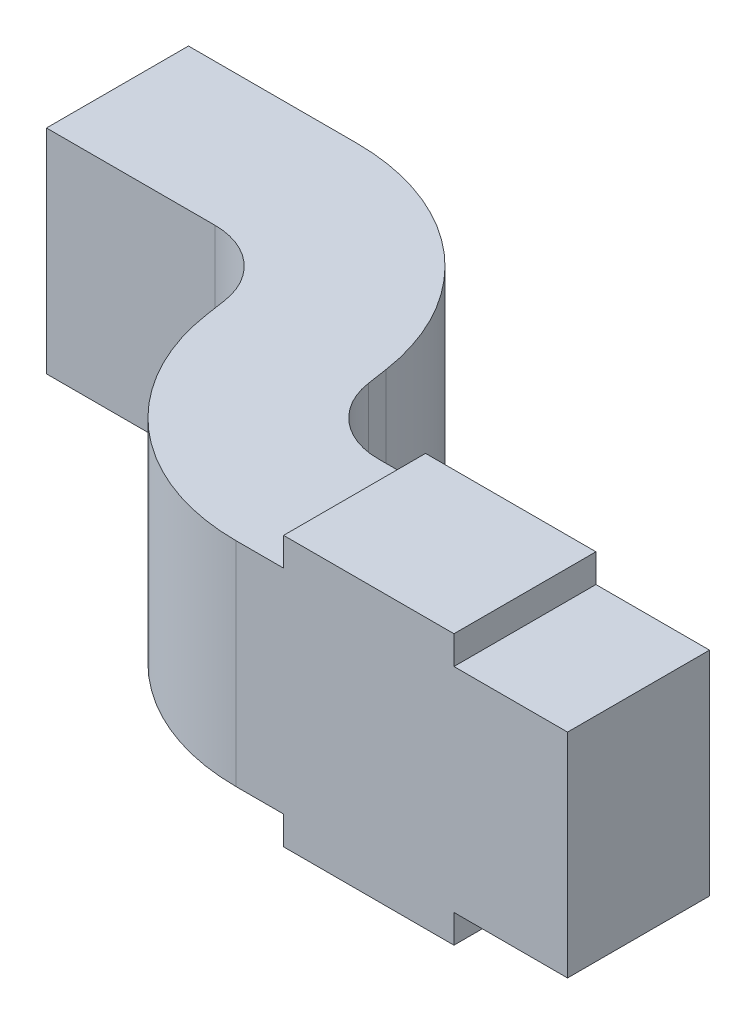
ISO-10303-21;
HEADER;
FILE_DESCRIPTION(('STEP AP214'),'2;1');
FILE_NAME('part.step','',(''),(''),'','','');
FILE_SCHEMA(('AUTOMOTIVE_DESIGN { 1 0 10303 214 1 1 1 1 }'));
ENDSEC;
DATA;
#1=APPLICATION_CONTEXT('core data for automotive mechanical design processes');
#2=APPLICATION_PROTOCOL_DEFINITION('international standard','automotive_design',2000,#1);
#3=PRODUCT_CONTEXT('',#1,'mechanical');
#4=PRODUCT('Part','Part','',(#3));
#5=PRODUCT_RELATED_PRODUCT_CATEGORY('part','',(#4));
#6=PRODUCT_DEFINITION_FORMATION('','',#4);
#7=PRODUCT_DEFINITION_CONTEXT('part definition',#1,'design');
#8=PRODUCT_DEFINITION('design','',#6,#7);
#9=PRODUCT_DEFINITION_SHAPE('','',#8);
#10=(LENGTH_UNIT() NAMED_UNIT(*) SI_UNIT(.MILLI.,.METRE.));
#11=(NAMED_UNIT(*) PLANE_ANGLE_UNIT() SI_UNIT($,.RADIAN.));
#12=(NAMED_UNIT(*) SI_UNIT($,.STERADIAN.) SOLID_ANGLE_UNIT());
#13=UNCERTAINTY_MEASURE_WITH_UNIT(LENGTH_MEASURE(1.E-05),#10,'distance_accuracy_value','');
#14=(GEOMETRIC_REPRESENTATION_CONTEXT(3) GLOBAL_UNCERTAINTY_ASSIGNED_CONTEXT((#13)) GLOBAL_UNIT_ASSIGNED_CONTEXT((#10,
#11,#12)) REPRESENTATION_CONTEXT('',''));
#15=CARTESIAN_POINT('',(0.,0.,0.));
#16=DIRECTION('',(0.,0.,1.));
#17=DIRECTION('',(1.,0.,0.));
#18=AXIS2_PLACEMENT_3D('',#15,#16,#17);
#19=CARTESIAN_POINT('',(-3.23,0.47500000000005,0.925));
#20=DIRECTION('',(0.,1.,0.));
#21=DIRECTION('',(1.,0.,0.));
#22=AXIS2_PLACEMENT_3D('',#19,#20,#21);
#23=PLANE('',#22);
#24=DIRECTION('',(1.,0.,0.));
#25=VECTOR('',#24,1.);
#26=CARTESIAN_POINT('',(-3.23,0.47500000000005,1.425));
#27=LINE('',#26,#25);
#28=CARTESIAN_POINT('',(-3.23,0.47500000000005,1.425));
#29=VERTEX_POINT('',#28);
#30=CARTESIAN_POINT('',(-2.63000000000008,0.47500000000005,1.425));
#31=VERTEX_POINT('',#30);
#32=EDGE_CURVE('E266',#29,#31,#27,.T.);
#33=ORIENTED_EDGE('',*,*,#32,.T.);
#34=DIRECTION('',(0.,0.,1.));
#35=VECTOR('',#34,1.);
#36=CARTESIAN_POINT('',(-2.63000000000008,0.47500000000005,0.925));
#37=LINE('',#36,#35);
#38=CARTESIAN_POINT('',(-2.63000000000008,0.47500000000005,0.925));
#39=VERTEX_POINT('',#38);
#40=EDGE_CURVE('E277',#39,#31,#37,.T.);
#41=ORIENTED_EDGE('',*,*,#40,.F.);
#42=DIRECTION('',(1.,0.,0.));
#43=VECTOR('',#42,1.);
#44=CARTESIAN_POINT('',(-3.23,0.47500000000005,0.925));
#45=LINE('',#44,#43);
#46=CARTESIAN_POINT('',(-3.23,0.47500000000005,0.925));
#47=VERTEX_POINT('',#46);
#48=EDGE_CURVE('E244',#47,#39,#45,.T.);
#49=ORIENTED_EDGE('',*,*,#48,.F.);
#50=DIRECTION('',(0.,0.,1.));
#51=VECTOR('',#50,1.);
#52=CARTESIAN_POINT('',(-3.23,0.47500000000005,0.925));
#53=LINE('',#52,#51);
#54=EDGE_CURVE('E390',#47,#29,#53,.T.);
#55=ORIENTED_EDGE('',*,*,#54,.T.);
#56=EDGE_LOOP('',(#33,#41,#49,#55));
#57=FACE_BOUND('',#56,.T.);
#58=ADVANCED_FACE('F17',(#57),#23,.T.);
#59=CARTESIAN_POINT('',(-3.23,-0.47499999999994,0.925));
#60=DIRECTION('',(-1.,0.,0.));
#61=DIRECTION('',(0.,0.,1.));
#62=AXIS2_PLACEMENT_3D('',#59,#60,#61);
#63=PLANE('',#62);
#64=DIRECTION('',(0.,0.,-1.));
#65=VECTOR('',#64,1.);
#66=CARTESIAN_POINT('',(-3.23,-0.375,0.85410254983609));
#67=LINE('',#66,#65);
#68=CARTESIAN_POINT('',(-3.23,-0.375,1.425));
#69=VERTEX_POINT('',#68);
#70=CARTESIAN_POINT('',(-3.23,-0.375,0.924999999999963));
#71=VERTEX_POINT('',#70);
#72=EDGE_CURVE('E240',#69,#71,#67,.T.);
#73=ORIENTED_EDGE('',*,*,#72,.T.);
#74=DIRECTION('',(0.,1.,0.));
#75=VECTOR('',#74,1.);
#76=CARTESIAN_POINT('',(-3.23,-0.47499999999994,0.925));
#77=LINE('',#76,#75);
#78=CARTESIAN_POINT('',(-3.23,-0.47499999999994,0.925));
#79=VERTEX_POINT('',#78);
#80=EDGE_CURVE('E237',#79,#71,#77,.T.);
#81=ORIENTED_EDGE('',*,*,#80,.F.);
#82=DIRECTION('',(0.,0.,1.));
#83=VECTOR('',#82,1.);
#84=CARTESIAN_POINT('',(-3.23,-0.47499999999994,0.925));
#85=LINE('',#84,#83);
#86=CARTESIAN_POINT('',(-3.23,-0.47499999999994,1.425));
#87=VERTEX_POINT('',#86);
#88=EDGE_CURVE('E11',#79,#87,#85,.T.);
#89=ORIENTED_EDGE('',*,*,#88,.T.);
#90=DIRECTION('',(0.,1.,0.));
#91=VECTOR('',#90,1.);
#92=CARTESIAN_POINT('',(-3.23,-0.47499999999994,1.425));
#93=LINE('',#92,#91);
#94=EDGE_CURVE('E270',#87,#69,#93,.T.);
#95=ORIENTED_EDGE('',*,*,#94,.T.);
#96=EDGE_LOOP('',(#73,#81,#89,#95));
#97=FACE_BOUND('',#96,.T.);
#98=ADVANCED_FACE('F238',(#97),#63,.T.);
#99=CARTESIAN_POINT('',(-2.63000000000008,-0.47499999999994,0.925));
#100=DIRECTION('',(0.,-1.,0.));
#101=DIRECTION('',(-1.,0.,0.));
#102=AXIS2_PLACEMENT_3D('',#99,#100,#101);
#103=PLANE('',#102);
#104=DIRECTION('',(-1.,0.,0.));
#105=VECTOR('',#104,1.);
#106=CARTESIAN_POINT('',(-2.63000000000008,-0.47499999999994,1.425));
#107=LINE('',#106,#105);
#108=CARTESIAN_POINT('',(-2.63000000000008,-0.47499999999994,1.425));
#109=VERTEX_POINT('',#108);
#110=EDGE_CURVE('E234',#109,#87,#107,.T.);
#111=ORIENTED_EDGE('',*,*,#110,.T.);
#112=ORIENTED_EDGE('',*,*,#88,.F.);
#113=DIRECTION('',(-1.,0.,0.));
#114=VECTOR('',#113,1.);
#115=CARTESIAN_POINT('',(-2.63000000000008,-0.47499999999994,0.925));
#116=LINE('',#115,#114);
#117=CARTESIAN_POINT('',(-2.63000000000008,-0.47499999999994,0.925));
#118=VERTEX_POINT('',#117);
#119=EDGE_CURVE('E231',#118,#79,#116,.T.);
#120=ORIENTED_EDGE('',*,*,#119,.F.);
#121=DIRECTION('',(0.,0.,1.));
#122=VECTOR('',#121,1.);
#123=CARTESIAN_POINT('',(-2.63000000000008,-0.47499999999994,0.925));
#124=LINE('',#123,#122);
#125=EDGE_CURVE('E25',#118,#109,#124,.T.);
#126=ORIENTED_EDGE('',*,*,#125,.T.);
#127=EDGE_LOOP('',(#111,#112,#120,#126));
#128=FACE_BOUND('',#127,.T.);
#129=ADVANCED_FACE('F229',(#128),#103,.T.);
#130=CARTESIAN_POINT('',(-2.63000000000008,0.47500000000005,0.925));
#131=DIRECTION('',(1.,0.,0.));
#132=DIRECTION('',(0.,-1.,0.));
#133=AXIS2_PLACEMENT_3D('',#130,#131,#132);
#134=PLANE('',#133);
#135=DIRECTION('',(0.,0.,1.));
#136=VECTOR('',#135,1.);
#137=CARTESIAN_POINT('',(-2.63000000000008,-0.375,0.85410254983609));
#138=LINE('',#137,#136);
#139=CARTESIAN_POINT('',(-2.63000000000008,-0.375,0.925));
#140=VERTEX_POINT('',#139);
#141=CARTESIAN_POINT('',(-2.63000000000008,-0.375,1.425));
#142=VERTEX_POINT('',#141);
#143=EDGE_CURVE('E473',#140,#142,#138,.T.);
#144=ORIENTED_EDGE('',*,*,#143,.T.);
#145=DIRECTION('',(0.,-1.,0.));
#146=VECTOR('',#145,1.);
#147=CARTESIAN_POINT('',(-2.63000000000008,0.47500000000005,1.425));
#148=LINE('',#147,#146);
#149=EDGE_CURVE('E275',#142,#109,#148,.T.);
#150=ORIENTED_EDGE('',*,*,#149,.T.);
#151=ORIENTED_EDGE('',*,*,#125,.F.);
#152=DIRECTION('',(0.,-1.,0.));
#153=VECTOR('',#152,1.);
#154=CARTESIAN_POINT('',(-2.63000000000008,0.47500000000005,0.925));
#155=LINE('',#154,#153);
#156=EDGE_CURVE('E248',#140,#118,#155,.T.);
#157=ORIENTED_EDGE('',*,*,#156,.F.);
#158=EDGE_LOOP('',(#144,#150,#151,#157));
#159=FACE_BOUND('',#158,.T.);
#160=ADVANCED_FACE('F551',(#159),#134,.T.);
#161=CARTESIAN_POINT('',(-2.63000000000008,0.47500000000005,0.925));
#162=DIRECTION('',(1.,0.,0.));
#163=DIRECTION('',(0.,-1.,0.));
#164=AXIS2_PLACEMENT_3D('',#161,#162,#163);
#165=PLANE('',#164);
#166=DIRECTION('',(0.,0.,-1.));
#167=VECTOR('',#166,1.);
#168=CARTESIAN_POINT('',(-2.63000000000008,0.375,0.85410254983609));
#169=LINE('',#168,#167);
#170=CARTESIAN_POINT('',(-2.63000000000008,0.375,1.425));
#171=VERTEX_POINT('',#170);
#172=CARTESIAN_POINT('',(-2.63000000000008,0.375,0.925));
#173=VERTEX_POINT('',#172);
#174=EDGE_CURVE('E312',#171,#173,#169,.T.);
#175=ORIENTED_EDGE('',*,*,#174,.T.);
#176=DIRECTION('',(0.,-1.,0.));
#177=VECTOR('',#176,1.);
#178=CARTESIAN_POINT('',(-2.63000000000008,0.47500000000005,0.925));
#179=LINE('',#178,#177);
#180=EDGE_CURVE('E260',#39,#173,#179,.T.);
#181=ORIENTED_EDGE('',*,*,#180,.F.);
#182=ORIENTED_EDGE('',*,*,#40,.T.);
#183=DIRECTION('',(0.,-1.,0.));
#184=VECTOR('',#183,1.);
#185=CARTESIAN_POINT('',(-2.63000000000008,0.47500000000005,1.425));
#186=LINE('',#185,#184);
#187=EDGE_CURVE('E263',#31,#171,#186,.T.);
#188=ORIENTED_EDGE('',*,*,#187,.T.);
#189=EDGE_LOOP('',(#175,#181,#182,#188));
#190=FACE_BOUND('',#189,.T.);
#191=ADVANCED_FACE('F553',(#190),#165,.T.);
#192=CARTESIAN_POINT('',(-2.93000000000004,0.,1.425));
#193=DIRECTION('',(0.,0.,1.));
#194=DIRECTION('',(1.,0.,0.));
#195=AXIS2_PLACEMENT_3D('',#192,#193,#194);
#196=PLANE('',#195);
#197=ORIENTED_EDGE('',*,*,#187,.F.);
#198=ORIENTED_EDGE('',*,*,#32,.F.);
#199=DIRECTION('',(0.,1.,0.));
#200=VECTOR('',#199,1.);
#201=CARTESIAN_POINT('',(-3.23,-0.47499999999994,1.425));
#202=LINE('',#201,#200);
#203=CARTESIAN_POINT('',(-3.23,0.375,1.425));
#204=VERTEX_POINT('',#203);
#205=EDGE_CURVE('E387',#204,#29,#202,.T.);
#206=ORIENTED_EDGE('',*,*,#205,.F.);
#207=DIRECTION('',(-1.,0.,0.));
#208=VECTOR('',#207,1.);
#209=CARTESIAN_POINT('',(-2.23000000000008,0.375,1.425));
#210=LINE('',#209,#208);
#211=CARTESIAN_POINT('',(-3.39710678118641,0.375,1.425));
#212=VERTEX_POINT('',#211);
#213=EDGE_CURVE('E384',#204,#212,#210,.T.);
#214=ORIENTED_EDGE('',*,*,#213,.T.);
#215=DIRECTION('',(0.,1.,0.));
#216=VECTOR('',#215,1.);
#217=CARTESIAN_POINT('',(-3.39710678118641,-0.375,1.425));
#218=LINE('',#217,#216);
#219=CARTESIAN_POINT('',(-3.39710678118641,-0.375,1.425));
#220=VERTEX_POINT('',#219);
#221=EDGE_CURVE('E372',#220,#212,#218,.T.);
#222=ORIENTED_EDGE('',*,*,#221,.F.);
#223=DIRECTION('',(-1.,0.,0.));
#224=VECTOR('',#223,1.);
#225=CARTESIAN_POINT('',(-2.23000000000008,-0.375,1.425));
#226=LINE('',#225,#224);
#227=EDGE_CURVE('E423',#69,#220,#226,.T.);
#228=ORIENTED_EDGE('',*,*,#227,.F.);
#229=ORIENTED_EDGE('',*,*,#94,.F.);
#230=ORIENTED_EDGE('',*,*,#110,.F.);
#231=ORIENTED_EDGE('',*,*,#149,.F.);
#232=DIRECTION('',(-1.,0.,0.));
#233=VECTOR('',#232,1.);
#234=CARTESIAN_POINT('',(-2.23000000000008,-0.375,1.425));
#235=LINE('',#234,#233);
#236=CARTESIAN_POINT('',(-2.23000000000008,-0.375,1.425));
#237=VERTEX_POINT('',#236);
#238=EDGE_CURVE('E430',#237,#142,#235,.T.);
#239=ORIENTED_EDGE('',*,*,#238,.F.);
#240=DIRECTION('',(0.,1.,0.));
#241=VECTOR('',#240,1.);
#242=CARTESIAN_POINT('',(-2.23000000000008,-0.375,1.425));
#243=LINE('',#242,#241);
#244=CARTESIAN_POINT('',(-2.23000000000008,0.375,1.425));
#245=VERTEX_POINT('',#244);
#246=EDGE_CURVE('E367',#237,#245,#243,.T.);
#247=ORIENTED_EDGE('',*,*,#246,.T.);
#248=DIRECTION('',(-1.,0.,0.));
#249=VECTOR('',#248,1.);
#250=CARTESIAN_POINT('',(-2.23000000000008,0.375,1.425));
#251=LINE('',#250,#249);
#252=EDGE_CURVE('E316',#245,#171,#251,.T.);
#253=ORIENTED_EDGE('',*,*,#252,.T.);
#254=EDGE_LOOP('',(#197,#198,#206,#214,#222,#228,#229,#230,#231,#239,#247,#253));
#255=FACE_BOUND('',#254,.T.);
#256=ADVANCED_FACE('F408',(#255),#196,.T.);
#257=CARTESIAN_POINT('',(-2.93000000000004,0.,0.925));
#258=DIRECTION('',(0.,0.,1.));
#259=DIRECTION('',(1.,0.,0.));
#260=AXIS2_PLACEMENT_3D('',#257,#258,#259);
#261=PLANE('',#260);
#262=ORIENTED_EDGE('',*,*,#156,.T.);
#263=ORIENTED_EDGE('',*,*,#119,.T.);
#264=ORIENTED_EDGE('',*,*,#80,.T.);
#265=DIRECTION('',(1.,0.,0.));
#266=VECTOR('',#265,1.);
#267=CARTESIAN_POINT('',(-3.39710678118641,-0.375,0.924999999999955));
#268=LINE('',#267,#266);
#269=CARTESIAN_POINT('',(-3.39710678118641,-0.375,0.924999999999955));
#270=VERTEX_POINT('',#269);
#271=EDGE_CURVE('E309',#270,#71,#268,.T.);
#272=ORIENTED_EDGE('',*,*,#271,.F.);
#273=DIRECTION('',(0.,1.,0.));
#274=VECTOR('',#273,1.);
#275=CARTESIAN_POINT('',(-3.39710678118641,-0.375,0.924999999999955));
#276=LINE('',#275,#274);
#277=CARTESIAN_POINT('',(-3.39710678118641,0.375,0.924999999999955));
#278=VERTEX_POINT('',#277);
#279=EDGE_CURVE('E492',#270,#278,#276,.T.);
#280=ORIENTED_EDGE('',*,*,#279,.T.);
#281=DIRECTION('',(1.,0.,0.));
#282=VECTOR('',#281,1.);
#283=CARTESIAN_POINT('',(-3.39710678118641,0.375,0.924999999999955));
#284=LINE('',#283,#282);
#285=CARTESIAN_POINT('',(-3.23,0.375,0.924999999999963));
#286=VERTEX_POINT('',#285);
#287=EDGE_CURVE('E330',#278,#286,#284,.T.);
#288=ORIENTED_EDGE('',*,*,#287,.T.);
#289=DIRECTION('',(0.,1.,0.));
#290=VECTOR('',#289,1.);
#291=CARTESIAN_POINT('',(-3.23,-0.47499999999994,0.925));
#292=LINE('',#291,#290);
#293=EDGE_CURVE('E255',#286,#47,#292,.T.);
#294=ORIENTED_EDGE('',*,*,#293,.T.);
#295=ORIENTED_EDGE('',*,*,#48,.T.);
#296=ORIENTED_EDGE('',*,*,#180,.T.);
#297=DIRECTION('',(1.,0.,0.));
#298=VECTOR('',#297,1.);
#299=CARTESIAN_POINT('',(-3.39710678118641,0.375,0.924999999999955));
#300=LINE('',#299,#298);
#301=CARTESIAN_POINT('',(-2.23000000000008,0.375,0.925000000000011));
#302=VERTEX_POINT('',#301);
#303=EDGE_CURVE('E321',#173,#302,#300,.T.);
#304=ORIENTED_EDGE('',*,*,#303,.T.);
#305=DIRECTION('',(0.,1.,0.));
#306=VECTOR('',#305,1.);
#307=CARTESIAN_POINT('',(-2.23000000000008,-0.375,0.925000000000011));
#308=LINE('',#307,#306);
#309=CARTESIAN_POINT('',(-2.23000000000008,-0.375,0.925000000000011));
#310=VERTEX_POINT('',#309);
#311=EDGE_CURVE('E370',#310,#302,#308,.T.);
#312=ORIENTED_EDGE('',*,*,#311,.F.);
#313=DIRECTION('',(1.,0.,0.));
#314=VECTOR('',#313,1.);
#315=CARTESIAN_POINT('',(-3.39710678118641,-0.375,0.924999999999955));
#316=LINE('',#315,#314);
#317=EDGE_CURVE('E480',#140,#310,#316,.T.);
#318=ORIENTED_EDGE('',*,*,#317,.F.);
#319=EDGE_LOOP('',(#262,#263,#264,#272,#280,#288,#294,#295,#296,#304,#312,#318));
#320=FACE_BOUND('',#319,.T.);
#321=ADVANCED_FACE('F246',(#320),#261,.F.);
#322=CARTESIAN_POINT('',(-3.23,-0.47499999999994,0.925));
#323=DIRECTION('',(-1.,0.,0.));
#324=DIRECTION('',(0.,0.,1.));
#325=AXIS2_PLACEMENT_3D('',#322,#323,#324);
#326=PLANE('',#325);
#327=DIRECTION('',(0.,0.,1.));
#328=VECTOR('',#327,1.);
#329=CARTESIAN_POINT('',(-3.23,0.375,0.85410254983609));
#330=LINE('',#329,#328);
#331=EDGE_CURVE('E326',#286,#204,#330,.T.);
#332=ORIENTED_EDGE('',*,*,#331,.T.);
#333=ORIENTED_EDGE('',*,*,#205,.T.);
#334=ORIENTED_EDGE('',*,*,#54,.F.);
#335=ORIENTED_EDGE('',*,*,#293,.F.);
#336=EDGE_LOOP('',(#332,#333,#334,#335));
#337=FACE_BOUND('',#336,.T.);
#338=ADVANCED_FACE('F404',(#337),#326,.T.);
#339=CARTESIAN_POINT('',(-3.64791907855811,0.375,0.78320509967218));
#340=DIRECTION('',(0.,-1.,0.));
#341=DIRECTION('',(-1.,0.,0.));
#342=AXIS2_PLACEMENT_3D('',#339,#340,#341);
#343=PLANE('',#342);
#344=ORIENTED_EDGE('',*,*,#331,.F.);
#345=ORIENTED_EDGE('',*,*,#287,.F.);
#346=CARTESIAN_POINT('',(-3.39710678118638,0.375,0.67499999999993));
#347=DIRECTION('',(0.,1.,0.));
#348=DIRECTION('',(-0.65224191465017,0.,0.758010873783141));
#349=AXIS2_PLACEMENT_3D('',#346,#347,#348);
#350=CIRCLE('',#349,0.250000000000025);
#351=CARTESIAN_POINT('',(-3.56016725984894,0.375,0.864502718445734));
#352=VERTEX_POINT('',#351);
#353=EDGE_CURVE('E520',#352,#278,#350,.T.);
#354=ORIENTED_EDGE('',*,*,#353,.F.);
#355=CARTESIAN_POINT('',(-3.39710678118638,0.375,0.67499999999993));
#356=DIRECTION('',(0.,1.,0.));
#357=DIRECTION('',(-0.65224191465017,0.,0.758010873783141));
#358=AXIS2_PLACEMENT_3D('',#355,#356,#357);
#359=CIRCLE('',#358,0.250000000000025);
#360=CARTESIAN_POINT('',(-3.64431001300739,0.375,0.7122902423867));
#361=VERTEX_POINT('',#360);
#362=EDGE_CURVE('E371',#361,#352,#359,.T.);
#363=ORIENTED_EDGE('',*,*,#362,.F.);
#364=DIRECTION('',(0.149160969547199,0.,0.988812927283892));
#365=VECTOR('',#364,1.);
#366=CARTESIAN_POINT('',(-3.65549708572354,0.375,0.638129272839649));
#367=LINE('',#366,#365);
#368=CARTESIAN_POINT('',(-3.65549708572354,0.375,0.638129272839649));
#369=VERTEX_POINT('',#368);
#370=EDGE_CURVE('E362',#369,#361,#367,.T.);
#371=ORIENTED_EDGE('',*,*,#370,.F.);
#372=CARTESIAN_POINT('',(-4.39710678118645,0.375,0.750000000000045));
#373=DIRECTION('',(0.,-1.,0.));
#374=DIRECTION('',(0.652241914650113,0.,-0.75801087378319));
#375=AXIS2_PLACEMENT_3D('',#372,#373,#374);
#376=CIRCLE('',#375,0.749999999999988);
#377=CARTESIAN_POINT('',(-3.90792534519888,0.375,0.181491844662661));
#378=VERTEX_POINT('',#377);
#379=EDGE_CURVE('E526',#378,#369,#376,.T.);
#380=ORIENTED_EDGE('',*,*,#379,.F.);
#381=CARTESIAN_POINT('',(-4.39710678118645,0.375,0.750000000000045));
#382=DIRECTION('',(0.,-1.,0.));
#383=DIRECTION('',(0.652241914650113,0.,-0.75801087378319));
#384=AXIS2_PLACEMENT_3D('',#381,#382,#383);
#385=CIRCLE('',#384,0.749999999999988);
#386=CARTESIAN_POINT('',(-4.39710678118638,0.375,0.));
#387=VERTEX_POINT('',#386);
#388=EDGE_CURVE('E359',#387,#378,#385,.T.);
#389=ORIENTED_EDGE('',*,*,#388,.F.);
#390=DIRECTION('',(1.,0.,0.));
#391=VECTOR('',#390,1.);
#392=CARTESIAN_POINT('',(-4.99,0.375,0.));
#393=LINE('',#392,#391);
#394=CARTESIAN_POINT('',(-4.99,0.375,0.));
#395=VERTEX_POINT('',#394);
#396=EDGE_CURVE('E351',#395,#387,#393,.T.);
#397=ORIENTED_EDGE('',*,*,#396,.F.);
#398=DIRECTION('',(0.,0.,-1.));
#399=VECTOR('',#398,1.);
#400=CARTESIAN_POINT('',(-4.99,0.375,0.499999999999943));
#401=LINE('',#400,#399);
#402=CARTESIAN_POINT('',(-4.99,0.375,0.499999999999943));
#403=VERTEX_POINT('',#402);
#404=EDGE_CURVE('E346',#403,#395,#401,.T.);
#405=ORIENTED_EDGE('',*,*,#404,.F.);
#406=DIRECTION('',(-1.,0.,-6.71122420360616E-13));
#407=VECTOR('',#406,1.);
#408=CARTESIAN_POINT('',(-4.39710678118624,0.375,0.500000000000341));
#409=LINE('',#408,#407);
#410=CARTESIAN_POINT('',(-4.39710678118624,0.375,0.500000000000341));
#411=VERTEX_POINT('',#410);
#412=EDGE_CURVE('E337',#411,#403,#409,.T.);
#413=ORIENTED_EDGE('',*,*,#412,.F.);
#414=CARTESIAN_POINT('',(-4.39710678118642,0.375,0.750000000000349));
#415=DIRECTION('',(0.,1.,0.));
#416=DIRECTION('',(0.652241914650429,0.,-0.758010873782918));
#417=AXIS2_PLACEMENT_3D('',#414,#415,#416);
#418=CIRCLE('',#417,0.250000000000008);
#419=CARTESIAN_POINT('',(-4.2340463025238,0.375,0.560497281554614));
#420=VERTEX_POINT('',#419);
#421=EDGE_CURVE('E471',#420,#411,#418,.T.);
#422=ORIENTED_EDGE('',*,*,#421,.F.);
#423=CARTESIAN_POINT('',(-4.39710678118642,0.375,0.750000000000349));
#424=DIRECTION('',(0.,1.,0.));
#425=DIRECTION('',(0.652241914650429,0.,-0.758010873782918));
#426=AXIS2_PLACEMENT_3D('',#423,#424,#425);
#427=CIRCLE('',#426,0.250000000000008);
#428=CARTESIAN_POINT('',(-4.14990354936543,0.375,0.712709757613595));
#429=VERTEX_POINT('',#428);
#430=EDGE_CURVE('E335',#429,#420,#427,.T.);
#431=ORIENTED_EDGE('',*,*,#430,.F.);
#432=DIRECTION('',(-0.149160969547128,0.,-0.988812927283903));
#433=VECTOR('',#432,1.);
#434=CARTESIAN_POINT('',(-4.13871647664934,0.375,0.786870727160306));
#435=LINE('',#434,#433);
#436=CARTESIAN_POINT('',(-4.13871647664934,0.375,0.786870727160306));
#437=VERTEX_POINT('',#436);
#438=EDGE_CURVE('E331',#437,#429,#435,.T.);
#439=ORIENTED_EDGE('',*,*,#438,.F.);
#440=CARTESIAN_POINT('',(-3.3971067811864,0.375,0.67500000000001));
#441=DIRECTION('',(0.,-1.,0.));
#442=DIRECTION('',(-0.652241914650137,0.,0.758010873783169));
#443=AXIS2_PLACEMENT_3D('',#440,#441,#442);
#444=CIRCLE('',#443,0.75);
#445=CARTESIAN_POINT('',(-3.886288217174,0.375,1.24350815533739));
#446=VERTEX_POINT('',#445);
#447=EDGE_CURVE('E414',#446,#437,#444,.T.);
#448=ORIENTED_EDGE('',*,*,#447,.F.);
#449=CARTESIAN_POINT('',(-3.3971067811864,0.375,0.67500000000001));
#450=DIRECTION('',(0.,-1.,0.));
#451=DIRECTION('',(-0.652241914650137,0.,0.758010873783169));
#452=AXIS2_PLACEMENT_3D('',#449,#450,#451);
#453=CIRCLE('',#452,0.75);
#454=EDGE_CURVE('E376',#212,#446,#453,.T.);
#455=ORIENTED_EDGE('',*,*,#454,.F.);
#456=ORIENTED_EDGE('',*,*,#213,.F.);
#457=EDGE_LOOP('',(#344,#345,#354,#363,#371,#380,#389,#397,#405,#413,#422,#431,#439,#448,#455,#456));
#458=FACE_BOUND('',#457,.T.);
#459=ADVANCED_FACE('F411',(#458),#343,.F.);
#460=CARTESIAN_POINT('',(-4.13871647664934,-0.375,0.786870727160306));
#461=DIRECTION('',(-0.988812927283903,0.,0.149160969547128));
#462=DIRECTION('',(0.,1.,0.));
#463=AXIS2_PLACEMENT_3D('',#460,#461,#462);
#464=PLANE('',#463);
#465=ORIENTED_EDGE('',*,*,#438,.T.);
#466=DIRECTION('',(0.,1.,0.));
#467=VECTOR('',#466,1.);
#468=CARTESIAN_POINT('',(-4.14990354936544,-0.375,0.712709757613595));
#469=LINE('',#468,#467);
#470=CARTESIAN_POINT('',(-4.14990354936544,-0.375,0.712709757613595));
#471=VERTEX_POINT('',#470);
#472=EDGE_CURVE('E325',#471,#429,#469,.T.);
#473=ORIENTED_EDGE('',*,*,#472,.F.);
#474=DIRECTION('',(-0.149160969547128,0.,-0.988812927283903));
#475=VECTOR('',#474,1.);
#476=CARTESIAN_POINT('',(-4.13871647664934,-0.375,0.786870727160306));
#477=LINE('',#476,#475);
#478=CARTESIAN_POINT('',(-4.13871647664934,-0.375,0.786870727160306));
#479=VERTEX_POINT('',#478);
#480=EDGE_CURVE('E443',#479,#471,#477,.T.);
#481=ORIENTED_EDGE('',*,*,#480,.F.);
#482=DIRECTION('',(0.,1.,0.));
#483=VECTOR('',#482,1.);
#484=CARTESIAN_POINT('',(-4.13871647664934,-0.375,0.786870727160306));
#485=LINE('',#484,#483);
#486=EDGE_CURVE('E499',#479,#437,#485,.T.);
#487=ORIENTED_EDGE('',*,*,#486,.T.);
#488=EDGE_LOOP('',(#465,#473,#481,#487));
#489=FACE_BOUND('',#488,.T.);
#490=ADVANCED_FACE('F593',(#489),#464,.T.);
#491=CARTESIAN_POINT('',(-3.3971067811864,-0.375,0.67500000000001));
#492=DIRECTION('',(0.,1.,0.));
#493=DIRECTION('',(-0.652241914650137,0.,0.758010873783169));
#494=AXIS2_PLACEMENT_3D('',#491,#492,#493);
#495=CYLINDRICAL_SURFACE('',#494,0.75);
#496=DIRECTION('',(0.,1.,0.));
#497=VECTOR('',#496,1.);
#498=CARTESIAN_POINT('',(-3.886288217174,-0.375,1.24350815533739));
#499=LINE('',#498,#497);
#500=CARTESIAN_POINT('',(-3.886288217174,-0.375,1.24350815533739));
#501=VERTEX_POINT('',#500);
#502=EDGE_CURVE('E493',#501,#446,#499,.T.);
#503=ORIENTED_EDGE('',*,*,#502,.F.);
#504=CARTESIAN_POINT('',(-3.3971067811864,-0.375,0.67500000000001));
#505=DIRECTION('',(0.,-1.,0.));
#506=DIRECTION('',(-0.652241914650137,0.,0.758010873783169));
#507=AXIS2_PLACEMENT_3D('',#504,#505,#506);
#508=CIRCLE('',#507,0.75);
#509=EDGE_CURVE('E420',#220,#501,#508,.T.);
#510=ORIENTED_EDGE('',*,*,#509,.F.);
#511=ORIENTED_EDGE('',*,*,#221,.T.);
#512=ORIENTED_EDGE('',*,*,#454,.T.);
#513=EDGE_LOOP('',(#503,#510,#511,#512));
#514=FACE_BOUND('',#513,.T.);
#515=ADVANCED_FACE('F419',(#514),#495,.T.);
#516=CARTESIAN_POINT('',(-2.23000000000008,-0.375,0.925000000000011));
#517=DIRECTION('',(1.,0.,0.));
#518=DIRECTION('',(0.,-1.,0.));
#519=AXIS2_PLACEMENT_3D('',#516,#517,#518);
#520=PLANE('',#519);
#521=DIRECTION('',(0.,0.,1.));
#522=VECTOR('',#521,1.);
#523=CARTESIAN_POINT('',(-2.23000000000008,0.375,0.925000000000011));
#524=LINE('',#523,#522);
#525=EDGE_CURVE('E317',#302,#245,#524,.T.);
#526=ORIENTED_EDGE('',*,*,#525,.T.);
#527=ORIENTED_EDGE('',*,*,#246,.F.);
#528=DIRECTION('',(0.,0.,1.));
#529=VECTOR('',#528,1.);
#530=CARTESIAN_POINT('',(-2.23000000000008,-0.375,0.925000000000011));
#531=LINE('',#530,#529);
#532=EDGE_CURVE('E436',#310,#237,#531,.T.);
#533=ORIENTED_EDGE('',*,*,#532,.F.);
#534=ORIENTED_EDGE('',*,*,#311,.T.);
#535=EDGE_LOOP('',(#526,#527,#533,#534));
#536=FACE_BOUND('',#535,.T.);
#537=ADVANCED_FACE('F547',(#536),#520,.T.);
#538=CARTESIAN_POINT('',(-3.39710678118638,-0.375,0.67499999999993));
#539=DIRECTION('',(0.,1.,0.));
#540=DIRECTION('',(-0.65224191465017,0.,0.758010873783141));
#541=AXIS2_PLACEMENT_3D('',#538,#539,#540);
#542=CYLINDRICAL_SURFACE('',#541,0.250000000000025);
#543=DIRECTION('',(0.,1.,0.));
#544=VECTOR('',#543,1.);
#545=CARTESIAN_POINT('',(-3.56016725984894,-0.375,0.864502718445734));
#546=LINE('',#545,#544);
#547=CARTESIAN_POINT('',(-3.56016725984894,-0.375,0.864502718445734));
#548=VERTEX_POINT('',#547);
#549=EDGE_CURVE('E516',#548,#352,#546,.T.);
#550=ORIENTED_EDGE('',*,*,#549,.F.);
#551=CARTESIAN_POINT('',(-3.39710678118638,-0.375,0.67499999999993));
#552=DIRECTION('',(0.,1.,0.));
#553=DIRECTION('',(-0.65224191465017,0.,0.758010873783141));
#554=AXIS2_PLACEMENT_3D('',#551,#552,#553);
#555=CIRCLE('',#554,0.250000000000025);
#556=CARTESIAN_POINT('',(-3.64431001300739,-0.375,0.7122902423867));
#557=VERTEX_POINT('',#556);
#558=EDGE_CURVE('E306',#557,#548,#555,.T.);
#559=ORIENTED_EDGE('',*,*,#558,.F.);
#560=DIRECTION('',(0.,1.,0.));
#561=VECTOR('',#560,1.);
#562=CARTESIAN_POINT('',(-3.64431001300739,-0.375,0.7122902423867));
#563=LINE('',#562,#561);
#564=EDGE_CURVE('E366',#557,#361,#563,.T.);
#565=ORIENTED_EDGE('',*,*,#564,.T.);
#566=ORIENTED_EDGE('',*,*,#362,.T.);
#567=EDGE_LOOP('',(#550,#559,#565,#566));
#568=FACE_BOUND('',#567,.T.);
#569=ADVANCED_FACE('F600',(#568),#542,.F.);
#570=CARTESIAN_POINT('',(-3.65549708572354,-0.375,0.638129272839649));
#571=DIRECTION('',(0.988812927283892,0.,-0.149160969547199));
#572=DIRECTION('',(0.,-1.,0.));
#573=AXIS2_PLACEMENT_3D('',#570,#571,#572);
#574=PLANE('',#573);
#575=ORIENTED_EDGE('',*,*,#370,.T.);
#576=ORIENTED_EDGE('',*,*,#564,.F.);
#577=DIRECTION('',(0.149160969547199,0.,0.988812927283892));
#578=VECTOR('',#577,1.);
#579=CARTESIAN_POINT('',(-3.65549708572354,-0.375,0.638129272839649));
#580=LINE('',#579,#578);
#581=CARTESIAN_POINT('',(-3.65549708572354,-0.375,0.638129272839649));
#582=VERTEX_POINT('',#581);
#583=EDGE_CURVE('E302',#582,#557,#580,.T.);
#584=ORIENTED_EDGE('',*,*,#583,.F.);
#585=DIRECTION('',(0.,1.,0.));
#586=VECTOR('',#585,1.);
#587=CARTESIAN_POINT('',(-3.65549708572354,-0.375,0.638129272839649));
#588=LINE('',#587,#586);
#589=EDGE_CURVE('E530',#582,#369,#588,.T.);
#590=ORIENTED_EDGE('',*,*,#589,.T.);
#591=EDGE_LOOP('',(#575,#576,#584,#590));
#592=FACE_BOUND('',#591,.T.);
#593=ADVANCED_FACE('F580',(#592),#574,.T.);
#594=CARTESIAN_POINT('',(-4.39710678118645,-0.375,0.750000000000045));
#595=DIRECTION('',(0.,1.,0.));
#596=DIRECTION('',(0.652241914650113,0.,-0.75801087378319));
#597=AXIS2_PLACEMENT_3D('',#594,#595,#596);
#598=CYLINDRICAL_SURFACE('',#597,0.749999999999988);
#599=DIRECTION('',(0.,1.,0.));
#600=VECTOR('',#599,1.);
#601=CARTESIAN_POINT('',(-3.90792534519888,-0.375,0.181491844662661));
#602=LINE('',#601,#600);
#603=CARTESIAN_POINT('',(-3.90792534519888,-0.375,0.181491844662661));
#604=VERTEX_POINT('',#603);
#605=EDGE_CURVE('E491',#604,#378,#602,.T.);
#606=ORIENTED_EDGE('',*,*,#605,.F.);
#607=CARTESIAN_POINT('',(-4.39710678118645,-0.375,0.750000000000045));
#608=DIRECTION('',(0.,-1.,0.));
#609=DIRECTION('',(0.652241914650113,0.,-0.75801087378319));
#610=AXIS2_PLACEMENT_3D('',#607,#608,#609);
#611=CIRCLE('',#610,0.749999999999988);
#612=CARTESIAN_POINT('',(-4.39710678118638,-0.375,0.));
#613=VERTEX_POINT('',#612);
#614=EDGE_CURVE('E299',#613,#604,#611,.T.);
#615=ORIENTED_EDGE('',*,*,#614,.F.);
#616=DIRECTION('',(0.,1.,0.));
#617=VECTOR('',#616,1.);
#618=CARTESIAN_POINT('',(-4.39710678118638,-0.375,0.));
#619=LINE('',#618,#617);
#620=EDGE_CURVE('E355',#613,#387,#619,.T.);
#621=ORIENTED_EDGE('',*,*,#620,.T.);
#622=ORIENTED_EDGE('',*,*,#388,.T.);
#623=EDGE_LOOP('',(#606,#615,#621,#622));
#624=FACE_BOUND('',#623,.T.);
#625=ADVANCED_FACE('F587',(#624),#598,.T.);
#626=CARTESIAN_POINT('',(-4.99,-0.375,0.));
#627=DIRECTION('',(0.,0.,-1.));
#628=DIRECTION('',(0.,-1.,0.));
#629=AXIS2_PLACEMENT_3D('',#626,#627,#628);
#630=PLANE('',#629);
#631=ORIENTED_EDGE('',*,*,#396,.T.);
#632=ORIENTED_EDGE('',*,*,#620,.F.);
#633=DIRECTION('',(1.,0.,0.));
#634=VECTOR('',#633,1.);
#635=CARTESIAN_POINT('',(-4.99,-0.375,0.));
#636=LINE('',#635,#634);
#637=CARTESIAN_POINT('',(-4.99,-0.375,0.));
#638=VERTEX_POINT('',#637);
#639=EDGE_CURVE('E295',#638,#613,#636,.T.);
#640=ORIENTED_EDGE('',*,*,#639,.F.);
#641=DIRECTION('',(0.,1.,0.));
#642=VECTOR('',#641,1.);
#643=CARTESIAN_POINT('',(-4.99,-0.375,0.));
#644=LINE('',#643,#642);
#645=EDGE_CURVE('E347',#638,#395,#644,.T.);
#646=ORIENTED_EDGE('',*,*,#645,.T.);
#647=EDGE_LOOP('',(#631,#632,#640,#646));
#648=FACE_BOUND('',#647,.T.);
#649=ADVANCED_FACE('F583',(#648),#630,.T.);
#650=CARTESIAN_POINT('',(-4.99,-0.375,0.499999999999943));
#651=DIRECTION('',(-1.,0.,0.));
#652=DIRECTION('',(0.,0.,1.));
#653=AXIS2_PLACEMENT_3D('',#650,#651,#652);
#654=PLANE('',#653);
#655=ORIENTED_EDGE('',*,*,#404,.T.);
#656=ORIENTED_EDGE('',*,*,#645,.F.);
#657=DIRECTION('',(0.,0.,-1.));
#658=VECTOR('',#657,1.);
#659=CARTESIAN_POINT('',(-4.99,-0.375,0.499999999999943));
#660=LINE('',#659,#658);
#661=CARTESIAN_POINT('',(-4.99,-0.375,0.499999999999943));
#662=VERTEX_POINT('',#661);
#663=EDGE_CURVE('E291',#662,#638,#660,.T.);
#664=ORIENTED_EDGE('',*,*,#663,.F.);
#665=DIRECTION('',(0.,1.,0.));
#666=VECTOR('',#665,1.);
#667=CARTESIAN_POINT('',(-4.99,-0.375,0.499999999999943));
#668=LINE('',#667,#666);
#669=EDGE_CURVE('E342',#662,#403,#668,.T.);
#670=ORIENTED_EDGE('',*,*,#669,.T.);
#671=EDGE_LOOP('',(#655,#656,#664,#670));
#672=FACE_BOUND('',#671,.T.);
#673=ADVANCED_FACE('F586',(#672),#654,.T.);
#674=CARTESIAN_POINT('',(-4.39710678118624,-0.375,0.500000000000341));
#675=DIRECTION('',(-6.71122420360616E-13,0.,1.));
#676=DIRECTION('',(1.,0.,6.71122420360616E-13));
#677=AXIS2_PLACEMENT_3D('',#674,#675,#676);
#678=PLANE('',#677);
#679=ORIENTED_EDGE('',*,*,#412,.T.);
#680=ORIENTED_EDGE('',*,*,#669,.F.);
#681=DIRECTION('',(-1.,0.,-6.71122420360616E-13));
#682=VECTOR('',#681,1.);
#683=CARTESIAN_POINT('',(-4.39710678118624,-0.375,0.500000000000341));
#684=LINE('',#683,#682);
#685=CARTESIAN_POINT('',(-4.39710678118624,-0.375,0.500000000000341));
#686=VERTEX_POINT('',#685);
#687=EDGE_CURVE('E289',#686,#662,#684,.T.);
#688=ORIENTED_EDGE('',*,*,#687,.F.);
#689=DIRECTION('',(0.,1.,0.));
#690=VECTOR('',#689,1.);
#691=CARTESIAN_POINT('',(-4.39710678118624,-0.375,0.500000000000341));
#692=LINE('',#691,#690);
#693=EDGE_CURVE('E465',#686,#411,#692,.T.);
#694=ORIENTED_EDGE('',*,*,#693,.T.);
#695=EDGE_LOOP('',(#679,#680,#688,#694));
#696=FACE_BOUND('',#695,.T.);
#697=ADVANCED_FACE('F464',(#696),#678,.T.);
#698=CARTESIAN_POINT('',(-4.39710678118642,-0.375,0.750000000000349));
#699=DIRECTION('',(0.,1.,0.));
#700=DIRECTION('',(0.652241914650429,0.,-0.758010873782918));
#701=AXIS2_PLACEMENT_3D('',#698,#699,#700);
#702=CYLINDRICAL_SURFACE('',#701,0.250000000000008);
#703=DIRECTION('',(0.,1.,0.));
#704=VECTOR('',#703,1.);
#705=CARTESIAN_POINT('',(-4.2340463025238,-0.375,0.560497281554614));
#706=LINE('',#705,#704);
#707=CARTESIAN_POINT('',(-4.2340463025238,-0.375,0.560497281554614));
#708=VERTEX_POINT('',#707);
#709=EDGE_CURVE('E482',#708,#420,#706,.T.);
#710=ORIENTED_EDGE('',*,*,#709,.F.);
#711=CARTESIAN_POINT('',(-4.39710678118642,-0.375,0.750000000000349));
#712=DIRECTION('',(0.,1.,0.));
#713=DIRECTION('',(0.652241914650429,0.,-0.758010873782918));
#714=AXIS2_PLACEMENT_3D('',#711,#712,#713);
#715=CIRCLE('',#714,0.250000000000008);
#716=EDGE_CURVE('E446',#471,#708,#715,.T.);
#717=ORIENTED_EDGE('',*,*,#716,.F.);
#718=ORIENTED_EDGE('',*,*,#472,.T.);
#719=ORIENTED_EDGE('',*,*,#430,.T.);
#720=EDGE_LOOP('',(#710,#717,#718,#719));
#721=FACE_BOUND('',#720,.T.);
#722=ADVANCED_FACE('F570',(#721),#702,.F.);
#723=CARTESIAN_POINT('',(-3.64791907855811,0.375,0.78320509967218));
#724=DIRECTION('',(0.,-1.,0.));
#725=DIRECTION('',(-1.,0.,0.));
#726=AXIS2_PLACEMENT_3D('',#723,#724,#725);
#727=PLANE('',#726);
#728=ORIENTED_EDGE('',*,*,#174,.F.);
#729=ORIENTED_EDGE('',*,*,#252,.F.);
#730=ORIENTED_EDGE('',*,*,#525,.F.);
#731=ORIENTED_EDGE('',*,*,#303,.F.);
#732=EDGE_LOOP('',(#728,#729,#730,#731));
#733=FACE_BOUND('',#732,.T.);
#734=ADVANCED_FACE('F568',(#733),#727,.F.);
#735=CARTESIAN_POINT('',(-3.64791907855811,-0.375,0.78320509967218));
#736=DIRECTION('',(0.,-1.,0.));
#737=DIRECTION('',(-1.,0.,0.));
#738=AXIS2_PLACEMENT_3D('',#735,#736,#737);
#739=PLANE('',#738);
#740=ORIENTED_EDGE('',*,*,#72,.F.);
#741=ORIENTED_EDGE('',*,*,#227,.T.);
#742=ORIENTED_EDGE('',*,*,#509,.T.);
#743=CARTESIAN_POINT('',(-3.3971067811864,-0.375,0.67500000000001));
#744=DIRECTION('',(0.,-1.,0.));
#745=DIRECTION('',(-0.652241914650137,0.,0.758010873783169));
#746=AXIS2_PLACEMENT_3D('',#743,#744,#745);
#747=CIRCLE('',#746,0.75);
#748=EDGE_CURVE('E496',#501,#479,#747,.T.);
#749=ORIENTED_EDGE('',*,*,#748,.T.);
#750=ORIENTED_EDGE('',*,*,#480,.T.);
#751=ORIENTED_EDGE('',*,*,#716,.T.);
#752=CARTESIAN_POINT('',(-4.39710678118642,-0.375,0.750000000000349));
#753=DIRECTION('',(0.,1.,0.));
#754=DIRECTION('',(0.652241914650429,0.,-0.758010873782918));
#755=AXIS2_PLACEMENT_3D('',#752,#753,#754);
#756=CIRCLE('',#755,0.250000000000008);
#757=EDGE_CURVE('E460',#708,#686,#756,.T.);
#758=ORIENTED_EDGE('',*,*,#757,.T.);
#759=ORIENTED_EDGE('',*,*,#687,.T.);
#760=ORIENTED_EDGE('',*,*,#663,.T.);
#761=ORIENTED_EDGE('',*,*,#639,.T.);
#762=ORIENTED_EDGE('',*,*,#614,.T.);
#763=CARTESIAN_POINT('',(-4.39710678118645,-0.375,0.750000000000045));
#764=DIRECTION('',(0.,-1.,0.));
#765=DIRECTION('',(0.652241914650113,0.,-0.75801087378319));
#766=AXIS2_PLACEMENT_3D('',#763,#764,#765);
#767=CIRCLE('',#766,0.749999999999988);
#768=EDGE_CURVE('E487',#604,#582,#767,.T.);
#769=ORIENTED_EDGE('',*,*,#768,.T.);
#770=ORIENTED_EDGE('',*,*,#583,.T.);
#771=ORIENTED_EDGE('',*,*,#558,.T.);
#772=CARTESIAN_POINT('',(-3.39710678118638,-0.375,0.67499999999993));
#773=DIRECTION('',(0.,1.,0.));
#774=DIRECTION('',(-0.65224191465017,0.,0.758010873783141));
#775=AXIS2_PLACEMENT_3D('',#772,#773,#774);
#776=CIRCLE('',#775,0.250000000000025);
#777=EDGE_CURVE('E511',#548,#270,#776,.T.);
#778=ORIENTED_EDGE('',*,*,#777,.T.);
#779=ORIENTED_EDGE('',*,*,#271,.T.);
#780=EDGE_LOOP('',(#740,#741,#742,#749,#750,#751,#758,#759,#760,#761,#762,#769,#770,#771,#778,#779));
#781=FACE_BOUND('',#780,.T.);
#782=ADVANCED_FACE('F427',(#781),#739,.T.);
#783=CARTESIAN_POINT('',(-3.64791907855811,-0.375,0.78320509967218));
#784=DIRECTION('',(0.,-1.,0.));
#785=DIRECTION('',(-1.,0.,0.));
#786=AXIS2_PLACEMENT_3D('',#783,#784,#785);
#787=PLANE('',#786);
#788=ORIENTED_EDGE('',*,*,#143,.F.);
#789=ORIENTED_EDGE('',*,*,#317,.T.);
#790=ORIENTED_EDGE('',*,*,#532,.T.);
#791=ORIENTED_EDGE('',*,*,#238,.T.);
#792=EDGE_LOOP('',(#788,#789,#790,#791));
#793=FACE_BOUND('',#792,.T.);
#794=ADVANCED_FACE('F541',(#793),#787,.T.);
#795=CARTESIAN_POINT('',(-4.39710678118642,-0.375,0.750000000000349));
#796=DIRECTION('',(0.,1.,0.));
#797=DIRECTION('',(0.652241914650429,0.,-0.758010873782918));
#798=AXIS2_PLACEMENT_3D('',#795,#796,#797);
#799=CYLINDRICAL_SURFACE('',#798,0.250000000000008);
#800=ORIENTED_EDGE('',*,*,#757,.F.);
#801=ORIENTED_EDGE('',*,*,#709,.T.);
#802=ORIENTED_EDGE('',*,*,#421,.T.);
#803=ORIENTED_EDGE('',*,*,#693,.F.);
#804=EDGE_LOOP('',(#800,#801,#802,#803));
#805=FACE_BOUND('',#804,.T.);
#806=ADVANCED_FACE('F468',(#805),#799,.F.);
#807=CARTESIAN_POINT('',(-4.39710678118645,-0.375,0.750000000000045));
#808=DIRECTION('',(0.,1.,0.));
#809=DIRECTION('',(0.652241914650113,0.,-0.75801087378319));
#810=AXIS2_PLACEMENT_3D('',#807,#808,#809);
#811=CYLINDRICAL_SURFACE('',#810,0.749999999999988);
#812=ORIENTED_EDGE('',*,*,#768,.F.);
#813=ORIENTED_EDGE('',*,*,#605,.T.);
#814=ORIENTED_EDGE('',*,*,#379,.T.);
#815=ORIENTED_EDGE('',*,*,#589,.F.);
#816=EDGE_LOOP('',(#812,#813,#814,#815));
#817=FACE_BOUND('',#816,.T.);
#818=ADVANCED_FACE('F724',(#817),#811,.T.);
#819=CARTESIAN_POINT('',(-3.39710678118638,-0.375,0.67499999999993));
#820=DIRECTION('',(0.,1.,0.));
#821=DIRECTION('',(-0.65224191465017,0.,0.758010873783141));
#822=AXIS2_PLACEMENT_3D('',#819,#820,#821);
#823=CYLINDRICAL_SURFACE('',#822,0.250000000000025);
#824=ORIENTED_EDGE('',*,*,#777,.F.);
#825=ORIENTED_EDGE('',*,*,#549,.T.);
#826=ORIENTED_EDGE('',*,*,#353,.T.);
#827=ORIENTED_EDGE('',*,*,#279,.F.);
#828=EDGE_LOOP('',(#824,#825,#826,#827));
#829=FACE_BOUND('',#828,.T.);
#830=ADVANCED_FACE('F733',(#829),#823,.F.);
#831=CARTESIAN_POINT('',(-3.3971067811864,-0.375,0.67500000000001));
#832=DIRECTION('',(0.,1.,0.));
#833=DIRECTION('',(-0.652241914650137,0.,0.758010873783169));
#834=AXIS2_PLACEMENT_3D('',#831,#832,#833);
#835=CYLINDRICAL_SURFACE('',#834,0.75);
#836=ORIENTED_EDGE('',*,*,#748,.F.);
#837=ORIENTED_EDGE('',*,*,#502,.T.);
#838=ORIENTED_EDGE('',*,*,#447,.T.);
#839=ORIENTED_EDGE('',*,*,#486,.F.);
#840=EDGE_LOOP('',(#836,#837,#838,#839));
#841=FACE_BOUND('',#840,.T.);
#842=ADVANCED_FACE('F744',(#841),#835,.T.);
#843=CLOSED_SHELL('',(#58,#98,#129,#160,#191,#256,#321,#338,#459,#490,#515,#537,#569,#593,#625,
#649,#673,#697,#722,#734,#782,#794,#806,#818,#830,#842));
#844=MANIFOLD_SOLID_BREP('B1',#843);
#845=ADVANCED_BREP_SHAPE_REPRESENTATION('',(#18,#844),#14);
#846=SHAPE_DEFINITION_REPRESENTATION(#9,#845);
ENDSEC;
END-ISO-10303-21;
